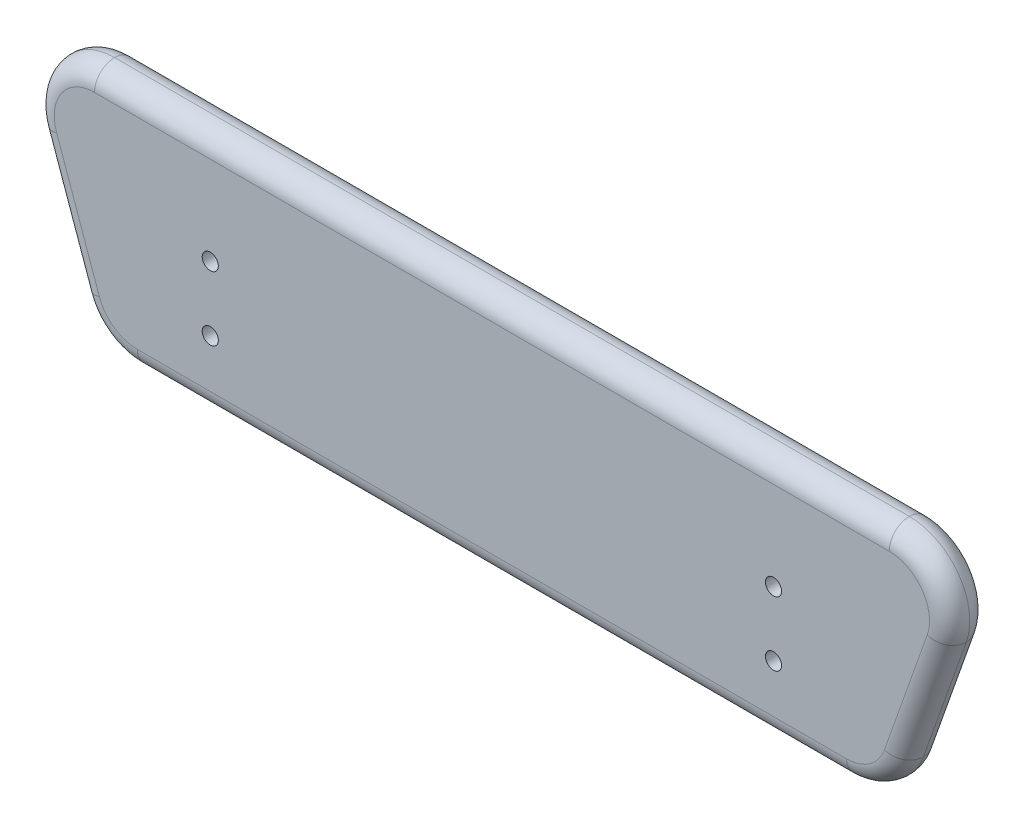
ISO-10303-21;
HEADER;
FILE_DESCRIPTION(('STEP AP214'),'2;1');
FILE_NAME('part.step','',(''),(''),'','','');
FILE_SCHEMA(('AUTOMOTIVE_DESIGN { 1 0 10303 214 1 1 1 1 }'));
ENDSEC;
DATA;
#1=APPLICATION_CONTEXT('core data for automotive mechanical design processes');
#2=APPLICATION_PROTOCOL_DEFINITION('international standard','automotive_design',2000,#1);
#3=PRODUCT_CONTEXT('',#1,'mechanical');
#4=PRODUCT('Part','Part','',(#3));
#5=PRODUCT_RELATED_PRODUCT_CATEGORY('part','',(#4));
#6=PRODUCT_DEFINITION_FORMATION('','',#4);
#7=PRODUCT_DEFINITION_CONTEXT('part definition',#1,'design');
#8=PRODUCT_DEFINITION('design','',#6,#7);
#9=PRODUCT_DEFINITION_SHAPE('','',#8);
#10=(LENGTH_UNIT() NAMED_UNIT(*) SI_UNIT(.MILLI.,.METRE.));
#11=(NAMED_UNIT(*) PLANE_ANGLE_UNIT() SI_UNIT($,.RADIAN.));
#12=(NAMED_UNIT(*) SI_UNIT($,.STERADIAN.) SOLID_ANGLE_UNIT());
#13=UNCERTAINTY_MEASURE_WITH_UNIT(LENGTH_MEASURE(1.E-05),#10,'distance_accuracy_value','');
#14=(GEOMETRIC_REPRESENTATION_CONTEXT(3) GLOBAL_UNCERTAINTY_ASSIGNED_CONTEXT((#13)) GLOBAL_UNIT_ASSIGNED_CONTEXT((#10,
#11,#12)) REPRESENTATION_CONTEXT('',''));
#15=CARTESIAN_POINT('',(0.,0.,0.));
#16=DIRECTION('',(0.,0.,1.));
#17=DIRECTION('',(1.,0.,0.));
#18=AXIS2_PLACEMENT_3D('',#15,#16,#17);
#19=CARTESIAN_POINT('',(0.,0.,10.));
#20=DIRECTION('',(0.,0.,-1.));
#21=DIRECTION('',(-1.,0.,0.));
#22=AXIS2_PLACEMENT_3D('',#19,#20,#21);
#23=PLANE('',#22);
#24=CARTESIAN_POINT('',(66.0538116591927,-23.5022421524665,10.));
#25=DIRECTION('',(0.,0.,1.));
#26=DIRECTION('',(-1.,0.,0.));
#27=AXIS2_PLACEMENT_3D('',#24,#25,#26);
#28=CIRCLE('',#27,2.);
#29=CARTESIAN_POINT('',(64.0538116591927,-23.5022421524665,10.));
#30=VERTEX_POINT('',#29);
#31=EDGE_CURVE('E542',#30,#30,#28,.T.);
#32=ORIENTED_EDGE('',*,*,#31,.F.);
#33=EDGE_LOOP('',(#32));
#34=FACE_BOUND('',#33,.T.);
#35=CARTESIAN_POINT('',(66.0538116591926,-39.5022421524665,10.));
#36=DIRECTION('',(0.,0.,1.));
#37=DIRECTION('',(-1.,0.,0.));
#38=AXIS2_PLACEMENT_3D('',#35,#36,#37);
#39=CIRCLE('',#38,2.);
#40=CARTESIAN_POINT('',(64.0538116591926,-39.5022421524665,10.));
#41=VERTEX_POINT('',#40);
#42=EDGE_CURVE('E541',#41,#41,#39,.T.);
#43=ORIENTED_EDGE('',*,*,#42,.F.);
#44=EDGE_LOOP('',(#43));
#45=FACE_BOUND('',#44,.T.);
#46=CARTESIAN_POINT('',(-73.9461883408073,-39.5022421524664,10.));
#47=DIRECTION('',(0.,0.,1.));
#48=DIRECTION('',(1.,0.,0.));
#49=AXIS2_PLACEMENT_3D('',#46,#47,#48);
#50=CIRCLE('',#49,2.);
#51=CARTESIAN_POINT('',(-71.9461883408073,-39.5022421524664,10.));
#52=VERTEX_POINT('',#51);
#53=EDGE_CURVE('E557',#52,#52,#50,.T.);
#54=ORIENTED_EDGE('',*,*,#53,.F.);
#55=EDGE_LOOP('',(#54));
#56=FACE_BOUND('',#55,.T.);
#57=CARTESIAN_POINT('',(-73.9461883408073,-23.5022421524664,10.));
#58=DIRECTION('',(0.,0.,1.));
#59=DIRECTION('',(1.,0.,0.));
#60=AXIS2_PLACEMENT_3D('',#57,#58,#59);
#61=CIRCLE('',#60,2.);
#62=CARTESIAN_POINT('',(-71.9461883408073,-23.5022421524664,10.));
#63=VERTEX_POINT('',#62);
#64=EDGE_CURVE('E226',#63,#63,#61,.T.);
#65=ORIENTED_EDGE('',*,*,#64,.F.);
#66=EDGE_LOOP('',(#65));
#67=FACE_BOUND('',#66,.T.);
#68=DIRECTION('',(0.333806859233768,-0.942641491092179,0.));
#69=VECTOR('',#68,1.);
#70=CARTESIAN_POINT('',(-104.321421400261,-36.9421528306335,10.));
#71=LINE('',#70,#69);
#72=CARTESIAN_POINT('',(-112.148094169994,-14.8403107448041,10.));
#73=VERTEX_POINT('',#72);
#74=CARTESIAN_POINT('',(-101.524536994073,-44.8403107448041,10.));
#75=VERTEX_POINT('',#74);
#76=EDGE_CURVE('E138',#73,#75,#71,.T.);
#77=ORIENTED_EDGE('',*,*,#76,.T.);
#78=CARTESIAN_POINT('',(-92.098122083151,-41.5022421524664,10.));
#79=DIRECTION('',(0.,0.,-1.));
#80=DIRECTION('',(-1.,0.,0.));
#81=AXIS2_PLACEMENT_3D('',#78,#79,#80);
#82=CIRCLE('',#81,10.);
#83=CARTESIAN_POINT('',(-92.098122083151,-51.5022421524664,10.));
#84=VERTEX_POINT('',#83);
#85=EDGE_CURVE('E11',#75,#84,#82,.F.);
#86=ORIENTED_EDGE('',*,*,#85,.T.);
#87=DIRECTION('',(1.,0.,0.));
#88=VECTOR('',#87,1.);
#89=CARTESIAN_POINT('',(0.,-51.5022421524664,10.));
#90=LINE('',#89,#88);
#91=CARTESIAN_POINT('',(84.2057454015362,-51.5022421524664,10.));
#92=VERTEX_POINT('',#91);
#93=EDGE_CURVE('E48',#84,#92,#90,.T.);
#94=ORIENTED_EDGE('',*,*,#93,.T.);
#95=CARTESIAN_POINT('',(84.2057454015362,-41.5022421524664,10.));
#96=DIRECTION('',(0.,0.,-1.));
#97=DIRECTION('',(-1.,0.,0.));
#98=AXIS2_PLACEMENT_3D('',#95,#96,#97);
#99=CIRCLE('',#98,10.);
#100=CARTESIAN_POINT('',(93.6321603124579,-44.8403107448041,10.));
#101=VERTEX_POINT('',#100);
#102=EDGE_CURVE('E135',#92,#101,#99,.F.);
#103=ORIENTED_EDGE('',*,*,#102,.T.);
#104=DIRECTION('',(0.333806859233775,0.942641491092177,0.));
#105=VECTOR('',#104,1.);
#106=CARTESIAN_POINT('',(97.3084687272462,-34.458736040841,10.));
#107=LINE('',#106,#105);
#108=CARTESIAN_POINT('',(104.255717488379,-14.8403107448041,10.));
#109=VERTEX_POINT('',#108);
#110=EDGE_CURVE('E153',#101,#109,#107,.T.);
#111=ORIENTED_EDGE('',*,*,#110,.T.);
#112=CARTESIAN_POINT('',(94.8293025774572,-11.5022421524664,10.));
#113=DIRECTION('',(0.,0.,-1.));
#114=DIRECTION('',(-1.,0.,0.));
#115=AXIS2_PLACEMENT_3D('',#112,#113,#114);
#116=CIRCLE('',#115,10.);
#117=CARTESIAN_POINT('',(94.8293025774572,-1.50224215246638,10.));
#118=VERTEX_POINT('',#117);
#119=EDGE_CURVE('E156',#109,#118,#116,.F.);
#120=ORIENTED_EDGE('',*,*,#119,.T.);
#121=DIRECTION('',(-1.,0.,0.));
#122=VECTOR('',#121,1.);
#123=CARTESIAN_POINT('',(0.,-1.50224215246638,10.));
#124=LINE('',#123,#122);
#125=CARTESIAN_POINT('',(-102.721679259072,-1.50224215246638,10.));
#126=VERTEX_POINT('',#125);
#127=EDGE_CURVE('E241',#118,#126,#124,.T.);
#128=ORIENTED_EDGE('',*,*,#127,.T.);
#129=CARTESIAN_POINT('',(-102.721679259072,-11.5022421524664,10.));
#130=DIRECTION('',(0.,0.,-1.));
#131=DIRECTION('',(-1.,0.,0.));
#132=AXIS2_PLACEMENT_3D('',#129,#130,#131);
#133=CIRCLE('',#132,10.);
#134=EDGE_CURVE('E243',#126,#73,#133,.F.);
#135=ORIENTED_EDGE('',*,*,#134,.T.);
#136=EDGE_LOOP('',(#77,#86,#94,#103,#111,#120,#128,#135));
#137=FACE_BOUND('',#136,.T.);
#138=ADVANCED_FACE('F38',(#34,#45,#56,#67,#137),#23,.F.);
#139=CARTESIAN_POINT('',(0.,0.,0.));
#140=DIRECTION('',(0.,0.,-1.));
#141=DIRECTION('',(-1.,0.,0.));
#142=AXIS2_PLACEMENT_3D('',#139,#140,#141);
#143=PLANE('',#142);
#144=DIRECTION('',(1.,0.,0.));
#145=VECTOR('',#144,1.);
#146=CARTESIAN_POINT('',(-92.098122083151,-51.5022421524664,0.));
#147=LINE('',#146,#145);
#148=CARTESIAN_POINT('',(84.2057454015362,-51.5022421524664,0.));
#149=VERTEX_POINT('',#148);
#150=CARTESIAN_POINT('',(-92.098122083151,-51.5022421524664,0.));
#151=VERTEX_POINT('',#150);
#152=EDGE_CURVE('E237',#149,#151,#147,.F.);
#153=ORIENTED_EDGE('',*,*,#152,.T.);
#154=CARTESIAN_POINT('',(-92.098122083151,-41.5022421524664,0.));
#155=DIRECTION('',(0.,0.,-1.));
#156=DIRECTION('',(-1.,0.,0.));
#157=AXIS2_PLACEMENT_3D('',#154,#155,#156);
#158=CIRCLE('',#157,10.);
#159=CARTESIAN_POINT('',(-101.524536994073,-44.8403107448041,0.));
#160=VERTEX_POINT('',#159);
#161=EDGE_CURVE('E239',#151,#160,#158,.T.);
#162=ORIENTED_EDGE('',*,*,#161,.T.);
#163=DIRECTION('',(0.333806859233768,-0.942641491092179,0.));
#164=VECTOR('',#163,1.);
#165=CARTESIAN_POINT('',(-112.148094169994,-14.8403107448041,0.));
#166=LINE('',#165,#164);
#167=CARTESIAN_POINT('',(-112.148094169994,-14.8403107448041,0.));
#168=VERTEX_POINT('',#167);
#169=EDGE_CURVE('E235',#160,#168,#166,.F.);
#170=ORIENTED_EDGE('',*,*,#169,.T.);
#171=CARTESIAN_POINT('',(-102.721679259072,-11.5022421524664,0.));
#172=DIRECTION('',(0.,0.,-1.));
#173=DIRECTION('',(-1.,0.,0.));
#174=AXIS2_PLACEMENT_3D('',#171,#172,#173);
#175=CIRCLE('',#174,10.);
#176=CARTESIAN_POINT('',(-102.721679259072,-1.50224215246638,0.));
#177=VERTEX_POINT('',#176);
#178=EDGE_CURVE('E96',#168,#177,#175,.T.);
#179=ORIENTED_EDGE('',*,*,#178,.T.);
#180=DIRECTION('',(-1.,0.,0.));
#181=VECTOR('',#180,1.);
#182=CARTESIAN_POINT('',(94.8293025774572,-1.50224215246638,0.));
#183=LINE('',#182,#181);
#184=CARTESIAN_POINT('',(94.8293025774572,-1.50224215246638,0.));
#185=VERTEX_POINT('',#184);
#186=EDGE_CURVE('E217',#177,#185,#183,.F.);
#187=ORIENTED_EDGE('',*,*,#186,.T.);
#188=CARTESIAN_POINT('',(94.8293025774572,-11.5022421524664,0.));
#189=DIRECTION('',(0.,0.,-1.));
#190=DIRECTION('',(-1.,0.,0.));
#191=AXIS2_PLACEMENT_3D('',#188,#189,#190);
#192=CIRCLE('',#191,10.);
#193=CARTESIAN_POINT('',(104.255717488379,-14.8403107448041,0.));
#194=VERTEX_POINT('',#193);
#195=EDGE_CURVE('E223',#185,#194,#192,.T.);
#196=ORIENTED_EDGE('',*,*,#195,.T.);
#197=DIRECTION('',(0.333806859233775,0.942641491092177,0.));
#198=VECTOR('',#197,1.);
#199=CARTESIAN_POINT('',(93.6321603124579,-44.8403107448041,0.));
#200=LINE('',#199,#198);
#201=CARTESIAN_POINT('',(93.6321603124579,-44.8403107448041,0.));
#202=VERTEX_POINT('',#201);
#203=EDGE_CURVE('E230',#194,#202,#200,.F.);
#204=ORIENTED_EDGE('',*,*,#203,.T.);
#205=CARTESIAN_POINT('',(84.2057454015362,-41.5022421524664,0.));
#206=DIRECTION('',(0.,0.,-1.));
#207=DIRECTION('',(-1.,0.,0.));
#208=AXIS2_PLACEMENT_3D('',#205,#206,#207);
#209=CIRCLE('',#208,10.);
#210=EDGE_CURVE('E232',#202,#149,#209,.T.);
#211=ORIENTED_EDGE('',*,*,#210,.T.);
#212=EDGE_LOOP('',(#153,#162,#170,#179,#187,#196,#204,#211));
#213=FACE_BOUND('',#212,.T.);
#214=ADVANCED_FACE('F293',(#213),#143,.T.);
#215=CARTESIAN_POINT('',(-102.721679259072,-11.5022421524664,5.));
#216=DIRECTION('',(0.,0.,-1.));
#217=DIRECTION('',(-1.,0.,0.));
#218=AXIS2_PLACEMENT_3D('',#215,#216,#217);
#219=TOROIDAL_SURFACE('',#218,10.,5.);
#220=CARTESIAN_POINT('',(-112.148094169994,-14.8403107448041,5.));
#221=DIRECTION('',(0.333806859233768,-0.94264149109218,0.));
#222=DIRECTION('',(0.94264149109218,0.333806859233768,0.));
#223=AXIS2_PLACEMENT_3D('',#220,#221,#222);
#224=CIRCLE('',#223,5.);
#225=CARTESIAN_POINT('',(-116.861301625455,-16.5093450409729,5.));
#226=VERTEX_POINT('',#225);
#227=EDGE_CURVE('E213',#73,#226,#224,.T.);
#228=ORIENTED_EDGE('',*,*,#227,.F.);
#229=ORIENTED_EDGE('',*,*,#134,.F.);
#230=CARTESIAN_POINT('',(-102.721679259072,-1.50224215246638,5.));
#231=DIRECTION('',(1.,0.,0.));
#232=DIRECTION('',(0.,0.,-1.));
#233=AXIS2_PLACEMENT_3D('',#230,#231,#232);
#234=CIRCLE('',#233,5.);
#235=CARTESIAN_POINT('',(-102.721679259072,3.49775784753362,5.));
#236=VERTEX_POINT('',#235);
#237=EDGE_CURVE('E42',#236,#126,#234,.T.);
#238=ORIENTED_EDGE('',*,*,#237,.F.);
#239=CARTESIAN_POINT('',(-102.721679259072,-11.5022421524664,5.));
#240=DIRECTION('',(0.,0.,-1.));
#241=DIRECTION('',(-1.,0.,0.));
#242=AXIS2_PLACEMENT_3D('',#239,#240,#241);
#243=CIRCLE('',#242,15.);
#244=EDGE_CURVE('E84',#226,#236,#243,.T.);
#245=ORIENTED_EDGE('',*,*,#244,.F.);
#246=EDGE_LOOP('',(#228,#229,#238,#245));
#247=FACE_BOUND('',#246,.T.);
#248=ADVANCED_FACE('F40',(#247),#219,.T.);
#249=CARTESIAN_POINT('',(0.,-1.50224215246638,5.));
#250=DIRECTION('',(-1.,0.,0.));
#251=DIRECTION('',(0.,0.,1.));
#252=AXIS2_PLACEMENT_3D('',#249,#250,#251);
#253=CYLINDRICAL_SURFACE('',#252,5.);
#254=ORIENTED_EDGE('',*,*,#237,.T.);
#255=ORIENTED_EDGE('',*,*,#127,.F.);
#256=CARTESIAN_POINT('',(94.8293025774572,-1.50224215246638,5.));
#257=DIRECTION('',(1.,0.,0.));
#258=DIRECTION('',(0.,0.,-1.));
#259=AXIS2_PLACEMENT_3D('',#256,#257,#258);
#260=CIRCLE('',#259,5.);
#261=CARTESIAN_POINT('',(94.8293025774572,3.49775784753362,5.));
#262=VERTEX_POINT('',#261);
#263=EDGE_CURVE('E210',#262,#118,#260,.T.);
#264=ORIENTED_EDGE('',*,*,#263,.F.);
#265=DIRECTION('',(-1.,0.,0.));
#266=VECTOR('',#265,1.);
#267=CARTESIAN_POINT('',(-123.946188340807,3.49775784753362,5.));
#268=LINE('',#267,#266);
#269=EDGE_CURVE('E207',#236,#262,#268,.F.);
#270=ORIENTED_EDGE('',*,*,#269,.F.);
#271=EDGE_LOOP('',(#254,#255,#264,#270));
#272=FACE_BOUND('',#271,.T.);
#273=ADVANCED_FACE('F246',(#272),#253,.T.);
#274=CARTESIAN_POINT('',(-102.721679259072,-11.5022421524664,5.));
#275=DIRECTION('',(0.,0.,-1.));
#276=DIRECTION('',(-1.,0.,0.));
#277=AXIS2_PLACEMENT_3D('',#274,#275,#276);
#278=TOROIDAL_SURFACE('',#277,10.,5.);
#279=CARTESIAN_POINT('',(-112.148094169994,-14.8403107448041,5.));
#280=DIRECTION('',(0.333806859233768,-0.94264149109218,0.));
#281=DIRECTION('',(0.94264149109218,0.333806859233768,0.));
#282=AXIS2_PLACEMENT_3D('',#279,#280,#281);
#283=CIRCLE('',#282,5.);
#284=EDGE_CURVE('E201',#226,#168,#283,.T.);
#285=ORIENTED_EDGE('',*,*,#284,.F.);
#286=ORIENTED_EDGE('',*,*,#244,.T.);
#287=CARTESIAN_POINT('',(-102.721679259072,-1.50224215246638,5.));
#288=DIRECTION('',(1.,0.,0.));
#289=DIRECTION('',(0.,0.,-1.));
#290=AXIS2_PLACEMENT_3D('',#287,#288,#289);
#291=CIRCLE('',#290,5.);
#292=EDGE_CURVE('E204',#177,#236,#291,.T.);
#293=ORIENTED_EDGE('',*,*,#292,.F.);
#294=ORIENTED_EDGE('',*,*,#178,.F.);
#295=EDGE_LOOP('',(#285,#286,#293,#294));
#296=FACE_BOUND('',#295,.T.);
#297=ADVANCED_FACE('F256',(#296),#278,.T.);
#298=CARTESIAN_POINT('',(-104.321421400261,-36.9421528306335,5.));
#299=DIRECTION('',(0.333806859233768,-0.942641491092179,0.));
#300=DIRECTION('',(0.942641491092179,0.333806859233768,0.));
#301=AXIS2_PLACEMENT_3D('',#298,#299,#300);
#302=CYLINDRICAL_SURFACE('',#301,5.);
#303=ORIENTED_EDGE('',*,*,#76,.F.);
#304=ORIENTED_EDGE('',*,*,#227,.T.);
#305=DIRECTION('',(0.333806859233768,-0.942641491092179,0.));
#306=VECTOR('',#305,1.);
#307=CARTESIAN_POINT('',(-123.946188340807,3.49775784753362,5.));
#308=LINE('',#307,#306);
#309=CARTESIAN_POINT('',(-106.237744449534,-46.5093450409729,5.));
#310=VERTEX_POINT('',#309);
#311=EDGE_CURVE('E198',#310,#226,#308,.F.);
#312=ORIENTED_EDGE('',*,*,#311,.F.);
#313=CARTESIAN_POINT('',(-101.524536994073,-44.8403107448041,5.));
#314=DIRECTION('',(0.333806859233768,-0.94264149109218,0.));
#315=DIRECTION('',(0.94264149109218,0.333806859233768,0.));
#316=AXIS2_PLACEMENT_3D('',#313,#314,#315);
#317=CIRCLE('',#316,5.);
#318=EDGE_CURVE('E195',#75,#310,#317,.T.);
#319=ORIENTED_EDGE('',*,*,#318,.F.);
#320=EDGE_LOOP('',(#303,#304,#312,#319));
#321=FACE_BOUND('',#320,.T.);
#322=ADVANCED_FACE('F264',(#321),#302,.T.);
#323=CARTESIAN_POINT('',(94.8293025774572,-11.5022421524664,5.));
#324=DIRECTION('',(0.,0.,-1.));
#325=DIRECTION('',(-1.,0.,0.));
#326=AXIS2_PLACEMENT_3D('',#323,#324,#325);
#327=TOROIDAL_SURFACE('',#326,10.,5.);
#328=ORIENTED_EDGE('',*,*,#263,.T.);
#329=ORIENTED_EDGE('',*,*,#119,.F.);
#330=CARTESIAN_POINT('',(104.255717488379,-14.8403107448041,5.));
#331=DIRECTION('',(-0.333806859233775,-0.942641491092177,0.));
#332=DIRECTION('',(0.942641491092177,-0.333806859233775,0.));
#333=AXIS2_PLACEMENT_3D('',#330,#331,#332);
#334=CIRCLE('',#333,5.);
#335=CARTESIAN_POINT('',(108.96892494384,-16.509345040973,5.));
#336=VERTEX_POINT('',#335);
#337=EDGE_CURVE('E192',#336,#109,#334,.T.);
#338=ORIENTED_EDGE('',*,*,#337,.F.);
#339=CARTESIAN_POINT('',(94.8293025774572,-11.5022421524664,5.));
#340=DIRECTION('',(0.,0.,-1.));
#341=DIRECTION('',(-1.,0.,0.));
#342=AXIS2_PLACEMENT_3D('',#339,#340,#341);
#343=CIRCLE('',#342,15.);
#344=EDGE_CURVE('E189',#262,#336,#343,.T.);
#345=ORIENTED_EDGE('',*,*,#344,.F.);
#346=EDGE_LOOP('',(#328,#329,#338,#345));
#347=FACE_BOUND('',#346,.T.);
#348=ADVANCED_FACE('F248',(#347),#327,.T.);
#349=CARTESIAN_POINT('',(-123.946188340807,-1.50224215246638,5.));
#350=DIRECTION('',(1.,0.,0.));
#351=DIRECTION('',(0.,0.,-1.));
#352=AXIS2_PLACEMENT_3D('',#349,#350,#351);
#353=CYLINDRICAL_SURFACE('',#352,5.);
#354=ORIENTED_EDGE('',*,*,#292,.T.);
#355=ORIENTED_EDGE('',*,*,#269,.T.);
#356=CARTESIAN_POINT('',(94.8293025774572,-1.50224215246638,5.));
#357=DIRECTION('',(1.,0.,0.));
#358=DIRECTION('',(0.,0.,-1.));
#359=AXIS2_PLACEMENT_3D('',#356,#357,#358);
#360=CIRCLE('',#359,5.);
#361=EDGE_CURVE('E186',#185,#262,#360,.T.);
#362=ORIENTED_EDGE('',*,*,#361,.F.);
#363=ORIENTED_EDGE('',*,*,#186,.F.);
#364=EDGE_LOOP('',(#354,#355,#362,#363));
#365=FACE_BOUND('',#364,.T.);
#366=ADVANCED_FACE('F255',(#365),#353,.T.);
#367=CARTESIAN_POINT('',(-119.232980885346,5.16679214370246,5.));
#368=DIRECTION('',(-0.333806859233768,0.942641491092179,0.));
#369=DIRECTION('',(-0.942641491092179,-0.333806859233768,0.));
#370=AXIS2_PLACEMENT_3D('',#367,#368,#369);
#371=CYLINDRICAL_SURFACE('',#370,5.);
#372=ORIENTED_EDGE('',*,*,#284,.T.);
#373=ORIENTED_EDGE('',*,*,#169,.F.);
#374=CARTESIAN_POINT('',(-101.524536994073,-44.8403107448041,5.));
#375=DIRECTION('',(0.333806859233768,-0.94264149109218,0.));
#376=DIRECTION('',(0.94264149109218,0.333806859233768,0.));
#377=AXIS2_PLACEMENT_3D('',#374,#375,#376);
#378=CIRCLE('',#377,5.);
#379=EDGE_CURVE('E183',#310,#160,#378,.T.);
#380=ORIENTED_EDGE('',*,*,#379,.F.);
#381=ORIENTED_EDGE('',*,*,#311,.T.);
#382=EDGE_LOOP('',(#372,#373,#380,#381));
#383=FACE_BOUND('',#382,.T.);
#384=ADVANCED_FACE('F259',(#383),#371,.T.);
#385=CARTESIAN_POINT('',(-92.098122083151,-41.5022421524664,5.));
#386=DIRECTION('',(0.,0.,-1.));
#387=DIRECTION('',(-1.,0.,0.));
#388=AXIS2_PLACEMENT_3D('',#385,#386,#387);
#389=TOROIDAL_SURFACE('',#388,10.,5.);
#390=ORIENTED_EDGE('',*,*,#85,.F.);
#391=ORIENTED_EDGE('',*,*,#318,.T.);
#392=CARTESIAN_POINT('',(-92.098122083151,-41.5022421524664,5.));
#393=DIRECTION('',(0.,0.,-1.));
#394=DIRECTION('',(-1.,0.,0.));
#395=AXIS2_PLACEMENT_3D('',#392,#393,#394);
#396=CIRCLE('',#395,15.);
#397=CARTESIAN_POINT('',(-92.098122083151,-56.5022421524664,5.));
#398=VERTEX_POINT('',#397);
#399=EDGE_CURVE('E180',#398,#310,#396,.T.);
#400=ORIENTED_EDGE('',*,*,#399,.F.);
#401=CARTESIAN_POINT('',(-92.098122083151,-51.5022421524664,5.));
#402=DIRECTION('',(1.,0.,0.));
#403=DIRECTION('',(0.,0.,-1.));
#404=AXIS2_PLACEMENT_3D('',#401,#402,#403);
#405=CIRCLE('',#404,5.);
#406=EDGE_CURVE('E148',#84,#398,#405,.T.);
#407=ORIENTED_EDGE('',*,*,#406,.F.);
#408=EDGE_LOOP('',(#390,#391,#400,#407));
#409=FACE_BOUND('',#408,.T.);
#410=ADVANCED_FACE('F266',(#409),#389,.T.);
#411=CARTESIAN_POINT('',(97.3084687272462,-34.458736040841,5.));
#412=DIRECTION('',(0.333806859233775,0.942641491092177,0.));
#413=DIRECTION('',(-0.942641491092177,0.333806859233775,0.));
#414=AXIS2_PLACEMENT_3D('',#411,#412,#413);
#415=CYLINDRICAL_SURFACE('',#414,5.);
#416=ORIENTED_EDGE('',*,*,#337,.T.);
#417=ORIENTED_EDGE('',*,*,#110,.F.);
#418=CARTESIAN_POINT('',(93.6321603124579,-44.8403107448041,5.));
#419=DIRECTION('',(-0.333806859233775,-0.942641491092177,0.));
#420=DIRECTION('',(0.942641491092177,-0.333806859233775,0.));
#421=AXIS2_PLACEMENT_3D('',#418,#419,#420);
#422=CIRCLE('',#421,5.);
#423=CARTESIAN_POINT('',(98.3453677679188,-46.509345040973,5.));
#424=VERTEX_POINT('',#423);
#425=EDGE_CURVE('E149',#424,#101,#422,.T.);
#426=ORIENTED_EDGE('',*,*,#425,.F.);
#427=DIRECTION('',(0.333806859233775,0.942641491092177,0.));
#428=VECTOR('',#427,1.);
#429=CARTESIAN_POINT('',(116.053811659193,3.49775784753362,5.));
#430=LINE('',#429,#428);
#431=EDGE_CURVE('E175',#336,#424,#430,.F.);
#432=ORIENTED_EDGE('',*,*,#431,.F.);
#433=EDGE_LOOP('',(#416,#417,#426,#432));
#434=FACE_BOUND('',#433,.T.);
#435=ADVANCED_FACE('F283',(#434),#415,.T.);
#436=CARTESIAN_POINT('',(94.8293025774572,-11.5022421524664,5.));
#437=DIRECTION('',(0.,0.,-1.));
#438=DIRECTION('',(-1.,0.,0.));
#439=AXIS2_PLACEMENT_3D('',#436,#437,#438);
#440=TOROIDAL_SURFACE('',#439,10.,5.);
#441=ORIENTED_EDGE('',*,*,#361,.T.);
#442=ORIENTED_EDGE('',*,*,#344,.T.);
#443=CARTESIAN_POINT('',(104.255717488379,-14.8403107448041,5.));
#444=DIRECTION('',(-0.333806859233775,-0.942641491092177,0.));
#445=DIRECTION('',(0.942641491092177,-0.333806859233775,0.));
#446=AXIS2_PLACEMENT_3D('',#443,#444,#445);
#447=CIRCLE('',#446,5.);
#448=EDGE_CURVE('E172',#194,#336,#447,.T.);
#449=ORIENTED_EDGE('',*,*,#448,.F.);
#450=ORIENTED_EDGE('',*,*,#195,.F.);
#451=EDGE_LOOP('',(#441,#442,#449,#450));
#452=FACE_BOUND('',#451,.T.);
#453=ADVANCED_FACE('F253',(#452),#440,.T.);
#454=CARTESIAN_POINT('',(-92.098122083151,-41.5022421524664,5.));
#455=DIRECTION('',(0.,0.,-1.));
#456=DIRECTION('',(-1.,0.,0.));
#457=AXIS2_PLACEMENT_3D('',#454,#455,#456);
#458=TOROIDAL_SURFACE('',#457,10.,5.);
#459=ORIENTED_EDGE('',*,*,#379,.T.);
#460=ORIENTED_EDGE('',*,*,#161,.F.);
#461=CARTESIAN_POINT('',(-92.098122083151,-51.5022421524664,5.));
#462=DIRECTION('',(1.,0.,0.));
#463=DIRECTION('',(0.,0.,-1.));
#464=AXIS2_PLACEMENT_3D('',#461,#462,#463);
#465=CIRCLE('',#464,5.);
#466=EDGE_CURVE('E169',#398,#151,#465,.T.);
#467=ORIENTED_EDGE('',*,*,#466,.F.);
#468=ORIENTED_EDGE('',*,*,#399,.T.);
#469=EDGE_LOOP('',(#459,#460,#467,#468));
#470=FACE_BOUND('',#469,.T.);
#471=ADVANCED_FACE('F270',(#470),#458,.T.);
#472=CARTESIAN_POINT('',(0.,-51.5022421524664,5.));
#473=DIRECTION('',(1.,0.,0.));
#474=DIRECTION('',(0.,1.,0.));
#475=AXIS2_PLACEMENT_3D('',#472,#473,#474);
#476=CYLINDRICAL_SURFACE('',#475,5.);
#477=CARTESIAN_POINT('',(84.2057454015362,-51.5022421524664,5.));
#478=DIRECTION('',(1.,0.,0.));
#479=DIRECTION('',(0.,0.,-1.));
#480=AXIS2_PLACEMENT_3D('',#477,#478,#479);
#481=CIRCLE('',#480,5.);
#482=CARTESIAN_POINT('',(84.2057454015362,-56.5022421524664,5.));
#483=VERTEX_POINT('',#482);
#484=EDGE_CURVE('E141',#92,#483,#481,.T.);
#485=ORIENTED_EDGE('',*,*,#484,.F.);
#486=ORIENTED_EDGE('',*,*,#93,.F.);
#487=ORIENTED_EDGE('',*,*,#406,.T.);
#488=DIRECTION('',(1.,0.,0.));
#489=VECTOR('',#488,1.);
#490=CARTESIAN_POINT('',(-102.699073988966,-56.5022421524664,5.));
#491=LINE('',#490,#489);
#492=EDGE_CURVE('E144',#483,#398,#491,.F.);
#493=ORIENTED_EDGE('',*,*,#492,.F.);
#494=EDGE_LOOP('',(#485,#486,#487,#493));
#495=FACE_BOUND('',#494,.T.);
#496=ADVANCED_FACE('F142',(#495),#476,.T.);
#497=CARTESIAN_POINT('',(84.2057454015362,-41.5022421524664,5.));
#498=DIRECTION('',(0.,0.,-1.));
#499=DIRECTION('',(-1.,0.,0.));
#500=AXIS2_PLACEMENT_3D('',#497,#498,#499);
#501=TOROIDAL_SURFACE('',#500,10.,5.);
#502=ORIENTED_EDGE('',*,*,#102,.F.);
#503=ORIENTED_EDGE('',*,*,#484,.T.);
#504=CARTESIAN_POINT('',(84.2057454015362,-41.5022421524664,5.));
#505=DIRECTION('',(0.,0.,-1.));
#506=DIRECTION('',(-1.,0.,0.));
#507=AXIS2_PLACEMENT_3D('',#504,#505,#506);
#508=CIRCLE('',#507,15.);
#509=EDGE_CURVE('E166',#424,#483,#508,.T.);
#510=ORIENTED_EDGE('',*,*,#509,.F.);
#511=ORIENTED_EDGE('',*,*,#425,.T.);
#512=EDGE_LOOP('',(#502,#503,#510,#511));
#513=FACE_BOUND('',#512,.T.);
#514=ADVANCED_FACE('F151',(#513),#501,.T.);
#515=CARTESIAN_POINT('',(111.340604203732,5.16679214370249,5.));
#516=DIRECTION('',(-0.333806859233775,-0.942641491092177,0.));
#517=DIRECTION('',(0.942641491092177,-0.333806859233775,0.));
#518=AXIS2_PLACEMENT_3D('',#515,#516,#517);
#519=CYLINDRICAL_SURFACE('',#518,5.);
#520=ORIENTED_EDGE('',*,*,#448,.T.);
#521=ORIENTED_EDGE('',*,*,#431,.T.);
#522=CARTESIAN_POINT('',(93.6321603124579,-44.8403107448041,5.));
#523=DIRECTION('',(-0.333806859233776,-0.942641491092177,0.));
#524=DIRECTION('',(0.942641491092177,-0.333806859233776,0.));
#525=AXIS2_PLACEMENT_3D('',#522,#523,#524);
#526=CIRCLE('',#525,5.);
#527=EDGE_CURVE('E162',#202,#424,#526,.T.);
#528=ORIENTED_EDGE('',*,*,#527,.F.);
#529=ORIENTED_EDGE('',*,*,#203,.F.);
#530=EDGE_LOOP('',(#520,#521,#528,#529));
#531=FACE_BOUND('',#530,.T.);
#532=ADVANCED_FACE('F281',(#531),#519,.T.);
#533=CARTESIAN_POINT('',(-102.699073988966,-51.5022421524664,5.));
#534=DIRECTION('',(-1.,0.,0.));
#535=DIRECTION('',(0.,-1.,0.));
#536=AXIS2_PLACEMENT_3D('',#533,#534,#535);
#537=CYLINDRICAL_SURFACE('',#536,5.);
#538=ORIENTED_EDGE('',*,*,#466,.T.);
#539=ORIENTED_EDGE('',*,*,#152,.F.);
#540=CARTESIAN_POINT('',(84.2057454015362,-51.5022421524664,5.));
#541=DIRECTION('',(1.,0.,0.));
#542=DIRECTION('',(0.,0.,-1.));
#543=AXIS2_PLACEMENT_3D('',#540,#541,#542);
#544=CIRCLE('',#543,5.);
#545=EDGE_CURVE('E160',#483,#149,#544,.T.);
#546=ORIENTED_EDGE('',*,*,#545,.F.);
#547=ORIENTED_EDGE('',*,*,#492,.T.);
#548=EDGE_LOOP('',(#538,#539,#546,#547));
#549=FACE_BOUND('',#548,.T.);
#550=ADVANCED_FACE('F274',(#549),#537,.T.);
#551=CARTESIAN_POINT('',(84.2057454015362,-41.5022421524664,5.));
#552=DIRECTION('',(0.,0.,-1.));
#553=DIRECTION('',(-1.,0.,0.));
#554=AXIS2_PLACEMENT_3D('',#551,#552,#553);
#555=TOROIDAL_SURFACE('',#554,10.,5.);
#556=ORIENTED_EDGE('',*,*,#527,.T.);
#557=ORIENTED_EDGE('',*,*,#509,.T.);
#558=ORIENTED_EDGE('',*,*,#545,.T.);
#559=ORIENTED_EDGE('',*,*,#210,.F.);
#560=EDGE_LOOP('',(#556,#557,#558,#559));
#561=FACE_BOUND('',#560,.T.);
#562=ADVANCED_FACE('F277',(#561),#555,.T.);
#563=CARTESIAN_POINT('',(-73.9461883408073,-23.5022421524664,2.5));
#564=DIRECTION('',(0.,0.,1.));
#565=DIRECTION('',(1.,0.,0.));
#566=AXIS2_PLACEMENT_3D('',#563,#564,#565);
#567=CYLINDRICAL_SURFACE('',#566,2.);
#568=CARTESIAN_POINT('',(-73.9461883408073,-23.5022421524664,2.5));
#569=DIRECTION('',(0.,0.,1.));
#570=DIRECTION('',(1.,0.,0.));
#571=AXIS2_PLACEMENT_3D('',#568,#569,#570);
#572=CIRCLE('',#571,2.);
#573=CARTESIAN_POINT('',(-71.9461883408073,-23.5022421524664,2.5));
#574=VERTEX_POINT('',#573);
#575=EDGE_CURVE('E163',#574,#574,#572,.T.);
#576=ORIENTED_EDGE('',*,*,#575,.F.);
#577=EDGE_LOOP('',(#576));
#578=FACE_BOUND('',#577,.T.);
#579=ORIENTED_EDGE('',*,*,#64,.T.);
#580=EDGE_LOOP('',(#579));
#581=FACE_BOUND('',#580,.T.);
#582=ADVANCED_FACE('F303',(#578,#581),#567,.F.);
#583=CARTESIAN_POINT('',(-73.9461883408073,-23.5022421524664,2.5));
#584=DIRECTION('',(0.,0.,1.));
#585=DIRECTION('',(1.,0.,0.));
#586=AXIS2_PLACEMENT_3D('',#583,#584,#585);
#587=PLANE('',#586);
#588=ORIENTED_EDGE('',*,*,#575,.T.);
#589=EDGE_LOOP('',(#588));
#590=FACE_BOUND('',#589,.T.);
#591=ADVANCED_FACE('F348',(#590),#587,.T.);
#592=CARTESIAN_POINT('',(-73.9461883408073,-39.5022421524664,2.5));
#593=DIRECTION('',(0.,0.,1.));
#594=DIRECTION('',(1.,0.,0.));
#595=AXIS2_PLACEMENT_3D('',#592,#593,#594);
#596=CYLINDRICAL_SURFACE('',#595,2.);
#597=CARTESIAN_POINT('',(-73.9461883408073,-39.5022421524664,2.5));
#598=DIRECTION('',(0.,0.,1.));
#599=DIRECTION('',(1.,0.,0.));
#600=AXIS2_PLACEMENT_3D('',#597,#598,#599);
#601=CIRCLE('',#600,2.);
#602=CARTESIAN_POINT('',(-71.9461883408073,-39.5022421524664,2.5));
#603=VERTEX_POINT('',#602);
#604=EDGE_CURVE('E553',#603,#603,#601,.T.);
#605=ORIENTED_EDGE('',*,*,#604,.F.);
#606=EDGE_LOOP('',(#605));
#607=FACE_BOUND('',#606,.T.);
#608=ORIENTED_EDGE('',*,*,#53,.T.);
#609=EDGE_LOOP('',(#608));
#610=FACE_BOUND('',#609,.T.);
#611=ADVANCED_FACE('F356',(#607,#610),#596,.F.);
#612=CARTESIAN_POINT('',(-73.9461883408073,-39.5022421524664,2.5));
#613=DIRECTION('',(0.,0.,1.));
#614=DIRECTION('',(1.,0.,0.));
#615=AXIS2_PLACEMENT_3D('',#612,#613,#614);
#616=PLANE('',#615);
#617=ORIENTED_EDGE('',*,*,#604,.T.);
#618=EDGE_LOOP('',(#617));
#619=FACE_BOUND('',#618,.T.);
#620=ADVANCED_FACE('F363',(#619),#616,.T.);
#621=CARTESIAN_POINT('',(66.0538116591926,-39.5022421524665,2.5));
#622=DIRECTION('',(0.,0.,1.));
#623=DIRECTION('',(1.,0.,0.));
#624=AXIS2_PLACEMENT_3D('',#621,#622,#623);
#625=CYLINDRICAL_SURFACE('',#624,2.);
#626=CARTESIAN_POINT('',(66.0538116591926,-39.5022421524665,2.5));
#627=DIRECTION('',(0.,0.,1.));
#628=DIRECTION('',(-1.,0.,0.));
#629=AXIS2_PLACEMENT_3D('',#626,#627,#628);
#630=CIRCLE('',#629,2.);
#631=CARTESIAN_POINT('',(64.0538116591926,-39.5022421524665,2.5));
#632=VERTEX_POINT('',#631);
#633=EDGE_CURVE('E545',#632,#632,#630,.T.);
#634=ORIENTED_EDGE('',*,*,#633,.F.);
#635=EDGE_LOOP('',(#634));
#636=FACE_BOUND('',#635,.T.);
#637=ORIENTED_EDGE('',*,*,#42,.T.);
#638=EDGE_LOOP('',(#637));
#639=FACE_BOUND('',#638,.T.);
#640=ADVANCED_FACE('F371',(#636,#639),#625,.F.);
#641=CARTESIAN_POINT('',(66.0538116591926,-39.5022421524665,2.5));
#642=DIRECTION('',(0.,0.,-1.));
#643=DIRECTION('',(-1.,0.,0.));
#644=AXIS2_PLACEMENT_3D('',#641,#642,#643);
#645=PLANE('',#644);
#646=ORIENTED_EDGE('',*,*,#633,.T.);
#647=EDGE_LOOP('',(#646));
#648=FACE_BOUND('',#647,.T.);
#649=ADVANCED_FACE('F379',(#648),#645,.F.);
#650=CARTESIAN_POINT('',(66.0538116591927,-23.5022421524665,2.5));
#651=DIRECTION('',(0.,0.,1.));
#652=DIRECTION('',(1.,0.,0.));
#653=AXIS2_PLACEMENT_3D('',#650,#651,#652);
#654=CYLINDRICAL_SURFACE('',#653,2.);
#655=CARTESIAN_POINT('',(66.0538116591927,-23.5022421524665,2.5));
#656=DIRECTION('',(0.,0.,1.));
#657=DIRECTION('',(-1.,0.,0.));
#658=AXIS2_PLACEMENT_3D('',#655,#656,#657);
#659=CIRCLE('',#658,2.);
#660=CARTESIAN_POINT('',(64.0538116591927,-23.5022421524665,2.5));
#661=VERTEX_POINT('',#660);
#662=EDGE_CURVE('E540',#661,#661,#659,.T.);
#663=ORIENTED_EDGE('',*,*,#662,.F.);
#664=EDGE_LOOP('',(#663));
#665=FACE_BOUND('',#664,.T.);
#666=ORIENTED_EDGE('',*,*,#31,.T.);
#667=EDGE_LOOP('',(#666));
#668=FACE_BOUND('',#667,.T.);
#669=ADVANCED_FACE('F387',(#665,#668),#654,.F.);
#670=CARTESIAN_POINT('',(66.0538116591927,-23.5022421524665,2.5));
#671=DIRECTION('',(0.,0.,-1.));
#672=DIRECTION('',(-1.,0.,0.));
#673=AXIS2_PLACEMENT_3D('',#670,#671,#672);
#674=PLANE('',#673);
#675=ORIENTED_EDGE('',*,*,#662,.T.);
#676=EDGE_LOOP('',(#675));
#677=FACE_BOUND('',#676,.T.);
#678=ADVANCED_FACE('F395',(#677),#674,.F.);
#679=CLOSED_SHELL('',(#138,#214,#248,#273,#297,#322,#348,#366,#384,#410,#435,#453,#471,#496,
#514,#532,#550,#562,#582,#591,#611,#620,#640,#649,#669,#678));
#680=MANIFOLD_SOLID_BREP('B2',#679);
#681=ADVANCED_BREP_SHAPE_REPRESENTATION('',(#18,#680),#14);
#682=SHAPE_DEFINITION_REPRESENTATION(#9,#681);
ENDSEC;
END-ISO-10303-21;
